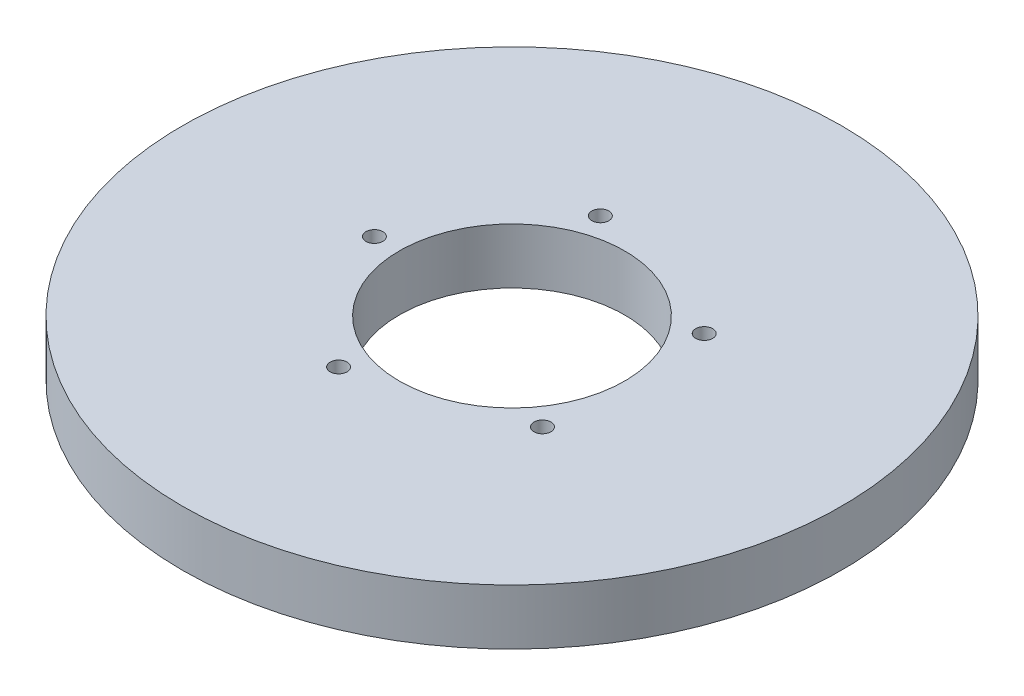
ISO-10303-21;
HEADER;
FILE_DESCRIPTION(('STEP AP214'),'2;1');
FILE_NAME('part.step','',(''),(''),'','','');
FILE_SCHEMA(('AUTOMOTIVE_DESIGN { 1 0 10303 214 1 1 1 1 }'));
ENDSEC;
DATA;
#1=APPLICATION_CONTEXT('core data for automotive mechanical design processes');
#2=APPLICATION_PROTOCOL_DEFINITION('international standard','automotive_design',2000,#1);
#3=PRODUCT_CONTEXT('',#1,'mechanical');
#4=PRODUCT('Part','Part','',(#3));
#5=PRODUCT_RELATED_PRODUCT_CATEGORY('part','',(#4));
#6=PRODUCT_DEFINITION_FORMATION('','',#4);
#7=PRODUCT_DEFINITION_CONTEXT('part definition',#1,'design');
#8=PRODUCT_DEFINITION('design','',#6,#7);
#9=PRODUCT_DEFINITION_SHAPE('','',#8);
#10=(LENGTH_UNIT() NAMED_UNIT(*) SI_UNIT(.MILLI.,.METRE.));
#11=(NAMED_UNIT(*) PLANE_ANGLE_UNIT() SI_UNIT($,.RADIAN.));
#12=(NAMED_UNIT(*) SI_UNIT($,.STERADIAN.) SOLID_ANGLE_UNIT());
#13=UNCERTAINTY_MEASURE_WITH_UNIT(LENGTH_MEASURE(1.E-05),#10,'distance_accuracy_value','');
#14=(GEOMETRIC_REPRESENTATION_CONTEXT(3) GLOBAL_UNCERTAINTY_ASSIGNED_CONTEXT((#13)) GLOBAL_UNIT_ASSIGNED_CONTEXT((#10,
#11,#12)) REPRESENTATION_CONTEXT('',''));
#15=CARTESIAN_POINT('',(0.,0.,0.));
#16=DIRECTION('',(0.,0.,1.));
#17=DIRECTION('',(1.,0.,0.));
#18=AXIS2_PLACEMENT_3D('',#15,#16,#17);
#19=CARTESIAN_POINT('',(0.,16.,0.));
#20=DIRECTION('',(0.,-1.,0.));
#21=DIRECTION('',(0.,0.,-1.));
#22=AXIS2_PLACEMENT_3D('',#19,#20,#21);
#23=CYLINDRICAL_SURFACE('',#22,95.);
#24=CARTESIAN_POINT('',(0.,16.,0.));
#25=DIRECTION('',(0.,1.,0.));
#26=DIRECTION('',(0.,0.,1.));
#27=AXIS2_PLACEMENT_3D('',#24,#25,#26);
#28=CIRCLE('',#27,95.);
#29=CARTESIAN_POINT('',(0.,16.,95.));
#30=VERTEX_POINT('',#29);
#31=EDGE_CURVE('E10',#30,#30,#28,.T.);
#32=ORIENTED_EDGE('',*,*,#31,.F.);
#33=EDGE_LOOP('',(#32));
#34=FACE_BOUND('',#33,.T.);
#35=CARTESIAN_POINT('',(0.,0.,0.));
#36=DIRECTION('',(0.,1.,0.));
#37=DIRECTION('',(0.,0.,1.));
#38=AXIS2_PLACEMENT_3D('',#35,#36,#37);
#39=CIRCLE('',#38,95.);
#40=CARTESIAN_POINT('',(0.,0.,95.));
#41=VERTEX_POINT('',#40);
#42=EDGE_CURVE('E37',#41,#41,#39,.T.);
#43=ORIENTED_EDGE('',*,*,#42,.T.);
#44=EDGE_LOOP('',(#43));
#45=FACE_BOUND('',#44,.T.);
#46=ADVANCED_FACE('F40',(#34,#45),#23,.T.);
#47=CARTESIAN_POINT('',(0.,16.,0.));
#48=DIRECTION('',(0.,1.,0.));
#49=DIRECTION('',(0.,0.,1.));
#50=AXIS2_PLACEMENT_3D('',#47,#48,#49);
#51=PLANE('',#50);
#52=CARTESIAN_POINT('',(-12.256311870602,16.,37.7210492706379));
#53=DIRECTION('',(0.,1.,0.));
#54=DIRECTION('',(0.951056516295155,0.,0.309016994374945));
#55=AXIS2_PLACEMENT_3D('',#52,#53,#54);
#56=CIRCLE('',#55,2.44474926012397);
#57=CARTESIAN_POINT('',(-9.93121715605339,16.,38.4765183390018));
#58=VERTEX_POINT('',#57);
#59=EDGE_CURVE('E78',#58,#58,#56,.T.);
#60=ORIENTED_EDGE('',*,*,#59,.F.);
#61=EDGE_LOOP('',(#60));
#62=FACE_BOUND('',#61,.T.);
#63=CARTESIAN_POINT('',(32.0874410539554,16.,23.3128905405635));
#64=DIRECTION('',(0.,1.,0.));
#65=DIRECTION('',(0.587785252292469,0.,-0.809016994374951));
#66=AXIS2_PLACEMENT_3D('',#63,#64,#65);
#67=CIRCLE('',#66,2.44474926012397);
#68=CARTESIAN_POINT('',(33.5244286146092,16.,21.3350468421376));
#69=VERTEX_POINT('',#68);
#70=EDGE_CURVE('E71',#69,#69,#67,.T.);
#71=ORIENTED_EDGE('',*,*,#70,.F.);
#72=EDGE_LOOP('',(#71));
#73=FACE_BOUND('',#72,.T.);
#74=CARTESIAN_POINT('',(32.087441053955,16.,-23.3128905405639));
#75=DIRECTION('',(0.,1.,0.));
#76=DIRECTION('',(-0.58778525229248,0.,-0.809016994374942));
#77=AXIS2_PLACEMENT_3D('',#74,#75,#76);
#78=CIRCLE('',#77,2.44474926012397);
#79=CARTESIAN_POINT('',(30.6504534933012,16.,-25.2907342389898));
#80=VERTEX_POINT('',#79);
#81=EDGE_CURVE('E70',#80,#80,#78,.T.);
#82=ORIENTED_EDGE('',*,*,#81,.F.);
#83=EDGE_LOOP('',(#82));
#84=FACE_BOUND('',#83,.T.);
#85=CARTESIAN_POINT('',(-12.2563118706026,16.,-37.7210492706377));
#86=DIRECTION('',(0.,1.,0.));
#87=DIRECTION('',(-0.95105651629515,0.,0.309016994374958));
#88=AXIS2_PLACEMENT_3D('',#85,#86,#87);
#89=CIRCLE('',#88,2.44474926012397);
#90=CARTESIAN_POINT('',(-14.5814065851512,16.,-36.9655802022738));
#91=VERTEX_POINT('',#90);
#92=EDGE_CURVE('E61',#91,#91,#89,.T.);
#93=ORIENTED_EDGE('',*,*,#92,.F.);
#94=EDGE_LOOP('',(#93));
#95=FACE_BOUND('',#94,.T.);
#96=CARTESIAN_POINT('',(-39.6622583667062,16.,0.));
#97=DIRECTION('',(0.,1.,0.));
#98=DIRECTION('',(0.,0.,1.));
#99=AXIS2_PLACEMENT_3D('',#96,#97,#98);
#100=CIRCLE('',#99,2.44474926012397);
#101=CARTESIAN_POINT('',(-39.6622583667062,16.,2.44474926012397));
#102=VERTEX_POINT('',#101);
#103=EDGE_CURVE('E54',#102,#102,#100,.T.);
#104=ORIENTED_EDGE('',*,*,#103,.F.);
#105=EDGE_LOOP('',(#104));
#106=FACE_BOUND('',#105,.T.);
#107=CARTESIAN_POINT('',(0.,16.,0.));
#108=DIRECTION('',(0.,1.,0.));
#109=DIRECTION('',(0.,0.,1.));
#110=AXIS2_PLACEMENT_3D('',#107,#108,#109);
#111=CIRCLE('',#110,32.5);
#112=CARTESIAN_POINT('',(0.,16.,32.5));
#113=VERTEX_POINT('',#112);
#114=EDGE_CURVE('E50',#113,#113,#111,.T.);
#115=ORIENTED_EDGE('',*,*,#114,.F.);
#116=EDGE_LOOP('',(#115));
#117=FACE_BOUND('',#116,.T.);
#118=ORIENTED_EDGE('',*,*,#31,.T.);
#119=EDGE_LOOP('',(#118));
#120=FACE_BOUND('',#119,.T.);
#121=ADVANCED_FACE('F94',(#62,#73,#84,#95,#106,#117,#120),#51,.T.);
#122=CARTESIAN_POINT('',(0.,0.,0.));
#123=DIRECTION('',(0.,1.,0.));
#124=DIRECTION('',(0.,0.,1.));
#125=AXIS2_PLACEMENT_3D('',#122,#123,#124);
#126=PLANE('',#125);
#127=CARTESIAN_POINT('',(0.,0.,0.));
#128=DIRECTION('',(0.,1.,0.));
#129=DIRECTION('',(0.,0.,1.));
#130=AXIS2_PLACEMENT_3D('',#127,#128,#129);
#131=CIRCLE('',#130,32.5);
#132=CARTESIAN_POINT('',(0.,0.,32.5));
#133=VERTEX_POINT('',#132);
#134=EDGE_CURVE('E47',#133,#133,#131,.T.);
#135=ORIENTED_EDGE('',*,*,#134,.T.);
#136=EDGE_LOOP('',(#135));
#137=FACE_BOUND('',#136,.T.);
#138=ORIENTED_EDGE('',*,*,#42,.F.);
#139=EDGE_LOOP('',(#138));
#140=FACE_BOUND('',#139,.T.);
#141=ADVANCED_FACE('F100',(#137,#140),#126,.F.);
#142=CARTESIAN_POINT('',(0.,16.,0.));
#143=DIRECTION('',(0.,-1.,0.));
#144=DIRECTION('',(0.,0.,-1.));
#145=AXIS2_PLACEMENT_3D('',#142,#143,#144);
#146=CYLINDRICAL_SURFACE('',#145,32.5);
#147=ORIENTED_EDGE('',*,*,#114,.T.);
#148=EDGE_LOOP('',(#147));
#149=FACE_BOUND('',#148,.T.);
#150=ORIENTED_EDGE('',*,*,#134,.F.);
#151=EDGE_LOOP('',(#150));
#152=FACE_BOUND('',#151,.T.);
#153=ADVANCED_FACE('F108',(#149,#152),#146,.F.);
#154=CARTESIAN_POINT('',(-39.6622583667062,5.33727286034983,0.));
#155=DIRECTION('',(0.,1.,0.));
#156=DIRECTION('',(0.,0.,1.));
#157=AXIS2_PLACEMENT_3D('',#154,#155,#156);
#158=CYLINDRICAL_SURFACE('',#157,2.44474926012397);
#159=CARTESIAN_POINT('',(-39.6622583667062,5.33727286034983,0.));
#160=DIRECTION('',(0.,1.,0.));
#161=DIRECTION('',(0.,0.,1.));
#162=AXIS2_PLACEMENT_3D('',#159,#160,#161);
#163=CIRCLE('',#162,2.44474926012397);
#164=CARTESIAN_POINT('',(-39.6622583667062,5.33727286034983,2.44474926012397));
#165=VERTEX_POINT('',#164);
#166=EDGE_CURVE('E55',#165,#165,#163,.T.);
#167=ORIENTED_EDGE('',*,*,#166,.F.);
#168=EDGE_LOOP('',(#167));
#169=FACE_BOUND('',#168,.T.);
#170=ORIENTED_EDGE('',*,*,#103,.T.);
#171=EDGE_LOOP('',(#170));
#172=FACE_BOUND('',#171,.T.);
#173=ADVANCED_FACE('F115',(#169,#172),#158,.F.);
#174=CARTESIAN_POINT('',(-39.6622583667062,5.33727286034983,0.));
#175=DIRECTION('',(0.,1.,0.));
#176=DIRECTION('',(0.,0.,1.));
#177=AXIS2_PLACEMENT_3D('',#174,#175,#176);
#178=PLANE('',#177);
#179=ORIENTED_EDGE('',*,*,#166,.T.);
#180=EDGE_LOOP('',(#179));
#181=FACE_BOUND('',#180,.T.);
#182=ADVANCED_FACE('F142',(#181),#178,.T.);
#183=CARTESIAN_POINT('',(-12.2563118706026,5.33727286034983,-37.7210492706377));
#184=DIRECTION('',(0.,1.,0.));
#185=DIRECTION('',(0.,0.,1.));
#186=AXIS2_PLACEMENT_3D('',#183,#184,#185);
#187=CYLINDRICAL_SURFACE('',#186,2.44474926012397);
#188=CARTESIAN_POINT('',(-12.2563118706026,5.33727286034983,-37.7210492706377));
#189=DIRECTION('',(0.,1.,0.));
#190=DIRECTION('',(-0.95105651629515,0.,0.309016994374958));
#191=AXIS2_PLACEMENT_3D('',#188,#189,#190);
#192=CIRCLE('',#191,2.44474926012397);
#193=CARTESIAN_POINT('',(-14.5814065851512,5.33727286034983,-36.9655802022738));
#194=VERTEX_POINT('',#193);
#195=EDGE_CURVE('E63',#194,#194,#192,.T.);
#196=ORIENTED_EDGE('',*,*,#195,.F.);
#197=EDGE_LOOP('',(#196));
#198=FACE_BOUND('',#197,.T.);
#199=ORIENTED_EDGE('',*,*,#92,.T.);
#200=EDGE_LOOP('',(#199));
#201=FACE_BOUND('',#200,.T.);
#202=ADVANCED_FACE('F147',(#198,#201),#187,.F.);
#203=CARTESIAN_POINT('',(-12.2563118706026,5.33727286034983,-37.7210492706377));
#204=DIRECTION('',(0.,1.,0.));
#205=DIRECTION('',(-0.95105651629515,0.,0.309016994374958));
#206=AXIS2_PLACEMENT_3D('',#203,#204,#205);
#207=PLANE('',#206);
#208=ORIENTED_EDGE('',*,*,#195,.T.);
#209=EDGE_LOOP('',(#208));
#210=FACE_BOUND('',#209,.T.);
#211=ADVANCED_FACE('F163',(#210),#207,.T.);
#212=CARTESIAN_POINT('',(32.087441053955,5.33727286034983,-23.3128905405639));
#213=DIRECTION('',(0.,1.,0.));
#214=DIRECTION('',(0.,0.,1.));
#215=AXIS2_PLACEMENT_3D('',#212,#213,#214);
#216=CYLINDRICAL_SURFACE('',#215,2.44474926012397);
#217=CARTESIAN_POINT('',(32.087441053955,5.33727286034983,-23.3128905405639));
#218=DIRECTION('',(0.,1.,0.));
#219=DIRECTION('',(-0.58778525229248,0.,-0.809016994374942));
#220=AXIS2_PLACEMENT_3D('',#217,#218,#219);
#221=CIRCLE('',#220,2.44474926012397);
#222=CARTESIAN_POINT('',(30.6504534933012,5.33727286034983,-25.2907342389898));
#223=VERTEX_POINT('',#222);
#224=EDGE_CURVE('E69',#223,#223,#221,.T.);
#225=ORIENTED_EDGE('',*,*,#224,.F.);
#226=EDGE_LOOP('',(#225));
#227=FACE_BOUND('',#226,.T.);
#228=ORIENTED_EDGE('',*,*,#81,.T.);
#229=EDGE_LOOP('',(#228));
#230=FACE_BOUND('',#229,.T.);
#231=ADVANCED_FACE('F172',(#227,#230),#216,.F.);
#232=CARTESIAN_POINT('',(32.087441053955,5.33727286034983,-23.3128905405639));
#233=DIRECTION('',(0.,1.,0.));
#234=DIRECTION('',(-0.58778525229248,0.,-0.809016994374942));
#235=AXIS2_PLACEMENT_3D('',#232,#233,#234);
#236=PLANE('',#235);
#237=ORIENTED_EDGE('',*,*,#224,.T.);
#238=EDGE_LOOP('',(#237));
#239=FACE_BOUND('',#238,.T.);
#240=ADVANCED_FACE('F185',(#239),#236,.T.);
#241=CARTESIAN_POINT('',(32.0874410539554,5.33727286034983,23.3128905405635));
#242=DIRECTION('',(0.,1.,0.));
#243=DIRECTION('',(0.,0.,1.));
#244=AXIS2_PLACEMENT_3D('',#241,#242,#243);
#245=CYLINDRICAL_SURFACE('',#244,2.44474926012397);
#246=CARTESIAN_POINT('',(32.0874410539554,5.33727286034983,23.3128905405635));
#247=DIRECTION('',(0.,1.,0.));
#248=DIRECTION('',(0.587785252292469,0.,-0.809016994374951));
#249=AXIS2_PLACEMENT_3D('',#246,#247,#248);
#250=CIRCLE('',#249,2.44474926012397);
#251=CARTESIAN_POINT('',(33.5244286146092,5.33727286034983,21.3350468421376));
#252=VERTEX_POINT('',#251);
#253=EDGE_CURVE('E76',#252,#252,#250,.T.);
#254=ORIENTED_EDGE('',*,*,#253,.F.);
#255=EDGE_LOOP('',(#254));
#256=FACE_BOUND('',#255,.T.);
#257=ORIENTED_EDGE('',*,*,#70,.T.);
#258=EDGE_LOOP('',(#257));
#259=FACE_BOUND('',#258,.T.);
#260=ADVANCED_FACE('F191',(#256,#259),#245,.F.);
#261=CARTESIAN_POINT('',(32.0874410539554,5.33727286034983,23.3128905405635));
#262=DIRECTION('',(0.,1.,0.));
#263=DIRECTION('',(0.587785252292469,0.,-0.809016994374951));
#264=AXIS2_PLACEMENT_3D('',#261,#262,#263);
#265=PLANE('',#264);
#266=ORIENTED_EDGE('',*,*,#253,.T.);
#267=EDGE_LOOP('',(#266));
#268=FACE_BOUND('',#267,.T.);
#269=ADVANCED_FACE('F89',(#268),#265,.T.);
#270=CARTESIAN_POINT('',(-12.256311870602,5.33727286034983,37.7210492706379));
#271=DIRECTION('',(0.,1.,0.));
#272=DIRECTION('',(0.,0.,1.));
#273=AXIS2_PLACEMENT_3D('',#270,#271,#272);
#274=CYLINDRICAL_SURFACE('',#273,2.44474926012397);
#275=CARTESIAN_POINT('',(-12.256311870602,5.33727286034983,37.7210492706379));
#276=DIRECTION('',(0.,1.,0.));
#277=DIRECTION('',(0.951056516295155,0.,0.309016994374945));
#278=AXIS2_PLACEMENT_3D('',#275,#276,#277);
#279=CIRCLE('',#278,2.44474926012397);
#280=CARTESIAN_POINT('',(-9.93121715605339,5.33727286034983,38.4765183390018));
#281=VERTEX_POINT('',#280);
#282=EDGE_CURVE('E59',#281,#281,#279,.T.);
#283=ORIENTED_EDGE('',*,*,#282,.F.);
#284=EDGE_LOOP('',(#283));
#285=FACE_BOUND('',#284,.T.);
#286=ORIENTED_EDGE('',*,*,#59,.T.);
#287=EDGE_LOOP('',(#286));
#288=FACE_BOUND('',#287,.T.);
#289=ADVANCED_FACE('F87',(#285,#288),#274,.F.);
#290=CARTESIAN_POINT('',(-12.256311870602,5.33727286034983,37.7210492706379));
#291=DIRECTION('',(0.,1.,0.));
#292=DIRECTION('',(0.951056516295155,0.,0.309016994374945));
#293=AXIS2_PLACEMENT_3D('',#290,#291,#292);
#294=PLANE('',#293);
#295=ORIENTED_EDGE('',*,*,#282,.T.);
#296=EDGE_LOOP('',(#295));
#297=FACE_BOUND('',#296,.T.);
#298=ADVANCED_FACE('F84',(#297),#294,.T.);
#299=CLOSED_SHELL('',(#46,#121,#141,#153,#173,#182,#202,#211,#231,#240,#260,#269,#289,#298));
#300=MANIFOLD_SOLID_BREP('B2',#299);
#301=ADVANCED_BREP_SHAPE_REPRESENTATION('',(#18,#300),#14);
#302=SHAPE_DEFINITION_REPRESENTATION(#9,#301);
ENDSEC;
END-ISO-10303-21;
